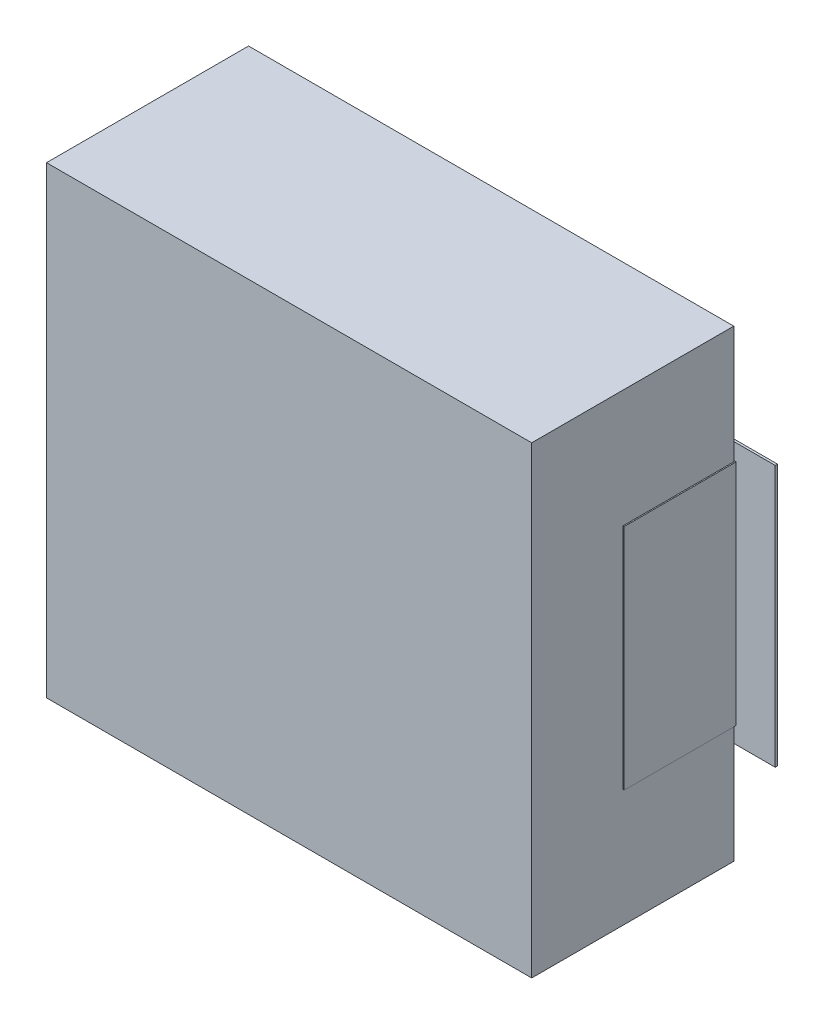
ISO-10303-21;
HEADER;
FILE_DESCRIPTION(('STEP AP214'),'2;1');
FILE_NAME('part.step','',(''),(''),'','','');
FILE_SCHEMA(('AUTOMOTIVE_DESIGN { 1 0 10303 214 1 1 1 1 }'));
ENDSEC;
DATA;
#1=APPLICATION_CONTEXT('core data for automotive mechanical design processes');
#2=APPLICATION_PROTOCOL_DEFINITION('international standard','automotive_design',2000,#1);
#3=PRODUCT_CONTEXT('',#1,'mechanical');
#4=PRODUCT('Part','Part','',(#3));
#5=PRODUCT_RELATED_PRODUCT_CATEGORY('part','',(#4));
#6=PRODUCT_DEFINITION_FORMATION('','',#4);
#7=PRODUCT_DEFINITION_CONTEXT('part definition',#1,'design');
#8=PRODUCT_DEFINITION('design','',#6,#7);
#9=PRODUCT_DEFINITION_SHAPE('','',#8);
#10=(LENGTH_UNIT() NAMED_UNIT(*) SI_UNIT(.MILLI.,.METRE.));
#11=(NAMED_UNIT(*) PLANE_ANGLE_UNIT() SI_UNIT($,.RADIAN.));
#12=(NAMED_UNIT(*) SI_UNIT($,.STERADIAN.) SOLID_ANGLE_UNIT());
#13=UNCERTAINTY_MEASURE_WITH_UNIT(LENGTH_MEASURE(1.E-05),#10,'distance_accuracy_value','');
#14=(GEOMETRIC_REPRESENTATION_CONTEXT(3) GLOBAL_UNCERTAINTY_ASSIGNED_CONTEXT((#13)) GLOBAL_UNIT_ASSIGNED_CONTEXT((#10,
#11,#12)) REPRESENTATION_CONTEXT('',''));
#15=CARTESIAN_POINT('',(0.,0.,0.));
#16=DIRECTION('',(0.,0.,1.));
#17=DIRECTION('',(1.,0.,0.));
#18=AXIS2_PLACEMENT_3D('',#15,#16,#17);
#19=CARTESIAN_POINT('',(0.,0.,0.0762));
#20=DIRECTION('',(0.,0.,1.));
#21=DIRECTION('',(1.,0.,0.));
#22=AXIS2_PLACEMENT_3D('',#19,#20,#21);
#23=PLANE('',#22);
#24=DIRECTION('',(1.,0.,0.));
#25=VECTOR('',#24,1.);
#26=CARTESIAN_POINT('',(-2.478,-1.145,0.0762));
#27=LINE('',#26,#25);
#28=CARTESIAN_POINT('',(-2.478,-1.145,0.0762));
#29=VERTEX_POINT('',#28);
#30=CARTESIAN_POINT('',(-1.078,-1.145,0.0762));
#31=VERTEX_POINT('',#30);
#32=EDGE_CURVE('E176',#29,#31,#27,.T.);
#33=ORIENTED_EDGE('',*,*,#32,.F.);
#34=DIRECTION('',(0.,1.,0.));
#35=VECTOR('',#34,1.);
#36=CARTESIAN_POINT('',(-2.478,1.145,0.0762));
#37=LINE('',#36,#35);
#38=CARTESIAN_POINT('',(-2.478,1.145,0.0762));
#39=VERTEX_POINT('',#38);
#40=EDGE_CURVE('E182',#39,#29,#37,.F.);
#41=ORIENTED_EDGE('',*,*,#40,.F.);
#42=DIRECTION('',(1.,0.,0.));
#43=VECTOR('',#42,1.);
#44=CARTESIAN_POINT('',(0.,1.145,0.0762));
#45=LINE('',#44,#43);
#46=CARTESIAN_POINT('',(-1.078,1.145,0.0762));
#47=VERTEX_POINT('',#46);
#48=EDGE_CURVE('E20',#47,#39,#45,.F.);
#49=ORIENTED_EDGE('',*,*,#48,.F.);
#50=DIRECTION('',(0.,1.,0.));
#51=VECTOR('',#50,1.);
#52=CARTESIAN_POINT('',(-1.078,-1.145,0.0762));
#53=LINE('',#52,#51);
#54=EDGE_CURVE('E192',#31,#47,#53,.T.);
#55=ORIENTED_EDGE('',*,*,#54,.F.);
#56=EDGE_LOOP('',(#33,#41,#49,#55));
#57=FACE_BOUND('',#56,.T.);
#58=ADVANCED_FACE('F17',(#57),#23,.F.);
#59=CARTESIAN_POINT('',(0.,0.,0.0762));
#60=DIRECTION('',(0.,0.,1.));
#61=DIRECTION('',(1.,0.,0.));
#62=AXIS2_PLACEMENT_3D('',#59,#60,#61);
#63=PLANE('',#62);
#64=DIRECTION('',(1.,0.,0.));
#65=VECTOR('',#64,1.);
#66=CARTESIAN_POINT('',(1.078,-1.145,0.0762));
#67=LINE('',#66,#65);
#68=CARTESIAN_POINT('',(1.078,-1.145,0.0762));
#69=VERTEX_POINT('',#68);
#70=CARTESIAN_POINT('',(2.478,-1.145,0.0762));
#71=VERTEX_POINT('',#70);
#72=EDGE_CURVE('E224',#69,#71,#67,.T.);
#73=ORIENTED_EDGE('',*,*,#72,.F.);
#74=DIRECTION('',(0.,1.,0.));
#75=VECTOR('',#74,1.);
#76=CARTESIAN_POINT('',(1.078,1.145,0.0762));
#77=LINE('',#76,#75);
#78=CARTESIAN_POINT('',(1.078,1.145,0.0762));
#79=VERTEX_POINT('',#78);
#80=EDGE_CURVE('E219',#79,#69,#77,.F.);
#81=ORIENTED_EDGE('',*,*,#80,.F.);
#82=DIRECTION('',(1.,0.,0.));
#83=VECTOR('',#82,1.);
#84=CARTESIAN_POINT('',(0.,1.145,0.0762));
#85=LINE('',#84,#83);
#86=CARTESIAN_POINT('',(2.478,1.145,0.0762));
#87=VERTEX_POINT('',#86);
#88=EDGE_CURVE('E189',#87,#79,#85,.F.);
#89=ORIENTED_EDGE('',*,*,#88,.F.);
#90=DIRECTION('',(0.,1.,0.));
#91=VECTOR('',#90,1.);
#92=CARTESIAN_POINT('',(2.478,-1.145,0.0762));
#93=LINE('',#92,#91);
#94=EDGE_CURVE('E229',#71,#87,#93,.T.);
#95=ORIENTED_EDGE('',*,*,#94,.F.);
#96=EDGE_LOOP('',(#73,#81,#89,#95));
#97=FACE_BOUND('',#96,.T.);
#98=ADVANCED_FACE('F647',(#97),#63,.F.);
#99=CARTESIAN_POINT('',(-2.478,1.145,0.0762));
#100=DIRECTION('',(-1.,0.,0.));
#101=DIRECTION('',(0.,0.,1.));
#102=AXIS2_PLACEMENT_3D('',#99,#100,#101);
#103=PLANE('',#102);
#104=DIRECTION('',(0.,0.,1.));
#105=VECTOR('',#104,1.);
#106=CARTESIAN_POINT('',(-2.478,1.145,0.0762));
#107=LINE('',#106,#105);
#108=CARTESIAN_POINT('',(-2.478,1.145,0.0962));
#109=VERTEX_POINT('',#108);
#110=EDGE_CURVE('E187',#39,#109,#107,.T.);
#111=ORIENTED_EDGE('',*,*,#110,.F.);
#112=ORIENTED_EDGE('',*,*,#40,.T.);
#113=DIRECTION('',(0.,0.,-1.));
#114=VECTOR('',#113,1.);
#115=CARTESIAN_POINT('',(-2.478,-1.145,0.0762));
#116=LINE('',#115,#114);
#117=CARTESIAN_POINT('',(-2.478,-1.145,0.0962));
#118=VERTEX_POINT('',#117);
#119=EDGE_CURVE('E184',#118,#29,#116,.T.);
#120=ORIENTED_EDGE('',*,*,#119,.F.);
#121=DIRECTION('',(0.,1.,0.));
#122=VECTOR('',#121,1.);
#123=CARTESIAN_POINT('',(-2.478,0.,0.0962));
#124=LINE('',#123,#122);
#125=EDGE_CURVE('E236',#109,#118,#124,.F.);
#126=ORIENTED_EDGE('',*,*,#125,.F.);
#127=EDGE_LOOP('',(#111,#112,#120,#126));
#128=FACE_BOUND('',#127,.T.);
#129=ADVANCED_FACE('F183',(#128),#103,.T.);
#130=CARTESIAN_POINT('',(-2.478,-1.145,0.0762));
#131=DIRECTION('',(0.,-1.,0.));
#132=DIRECTION('',(0.,0.,-1.));
#133=AXIS2_PLACEMENT_3D('',#130,#131,#132);
#134=PLANE('',#133);
#135=ORIENTED_EDGE('',*,*,#119,.T.);
#136=ORIENTED_EDGE('',*,*,#32,.T.);
#137=DIRECTION('',(0.,0.,-1.));
#138=VECTOR('',#137,1.);
#139=CARTESIAN_POINT('',(-1.078,-1.145,0.0762));
#140=LINE('',#139,#138);
#141=CARTESIAN_POINT('',(-1.078,-1.145,0.0962));
#142=VERTEX_POINT('',#141);
#143=EDGE_CURVE('E194',#142,#31,#140,.T.);
#144=ORIENTED_EDGE('',*,*,#143,.F.);
#145=DIRECTION('',(1.,0.,0.));
#146=VECTOR('',#145,1.);
#147=CARTESIAN_POINT('',(0.,-1.145,0.0962));
#148=LINE('',#147,#146);
#149=EDGE_CURVE('E198',#118,#142,#148,.T.);
#150=ORIENTED_EDGE('',*,*,#149,.F.);
#151=EDGE_LOOP('',(#135,#136,#144,#150));
#152=FACE_BOUND('',#151,.T.);
#153=ADVANCED_FACE('F196',(#152),#134,.T.);
#154=CARTESIAN_POINT('',(-1.078,-1.145,0.0762));
#155=DIRECTION('',(1.,0.,0.));
#156=DIRECTION('',(0.,0.,-1.));
#157=AXIS2_PLACEMENT_3D('',#154,#155,#156);
#158=PLANE('',#157);
#159=ORIENTED_EDGE('',*,*,#143,.T.);
#160=ORIENTED_EDGE('',*,*,#54,.T.);
#161=DIRECTION('',(0.,0.,1.));
#162=VECTOR('',#161,1.);
#163=CARTESIAN_POINT('',(-1.078,1.145,0.0762));
#164=LINE('',#163,#162);
#165=CARTESIAN_POINT('',(-1.078,1.145,0.0962));
#166=VERTEX_POINT('',#165);
#167=EDGE_CURVE('E211',#166,#47,#164,.F.);
#168=ORIENTED_EDGE('',*,*,#167,.F.);
#169=DIRECTION('',(0.,1.,0.));
#170=VECTOR('',#169,1.);
#171=CARTESIAN_POINT('',(-1.078,0.,0.0962));
#172=LINE('',#171,#170);
#173=EDGE_CURVE('E239',#142,#166,#172,.T.);
#174=ORIENTED_EDGE('',*,*,#173,.F.);
#175=EDGE_LOOP('',(#159,#160,#168,#174));
#176=FACE_BOUND('',#175,.T.);
#177=ADVANCED_FACE('F213',(#176),#158,.T.);
#178=CARTESIAN_POINT('',(-1.078,1.145,0.0762));
#179=DIRECTION('',(0.,1.,0.));
#180=DIRECTION('',(0.,0.,1.));
#181=AXIS2_PLACEMENT_3D('',#178,#179,#180);
#182=PLANE('',#181);
#183=ORIENTED_EDGE('',*,*,#167,.T.);
#184=ORIENTED_EDGE('',*,*,#48,.T.);
#185=ORIENTED_EDGE('',*,*,#110,.T.);
#186=DIRECTION('',(1.,0.,0.));
#187=VECTOR('',#186,1.);
#188=CARTESIAN_POINT('',(0.,1.145,0.0962));
#189=LINE('',#188,#187);
#190=EDGE_CURVE('E242',#166,#109,#189,.F.);
#191=ORIENTED_EDGE('',*,*,#190,.F.);
#192=EDGE_LOOP('',(#183,#184,#185,#191));
#193=FACE_BOUND('',#192,.T.);
#194=ADVANCED_FACE('F208',(#193),#182,.T.);
#195=CARTESIAN_POINT('',(1.078,1.145,0.0762));
#196=DIRECTION('',(-1.,0.,0.));
#197=DIRECTION('',(0.,0.,1.));
#198=AXIS2_PLACEMENT_3D('',#195,#196,#197);
#199=PLANE('',#198);
#200=DIRECTION('',(0.,0.,1.));
#201=VECTOR('',#200,1.);
#202=CARTESIAN_POINT('',(1.078,1.145,0.0762));
#203=LINE('',#202,#201);
#204=CARTESIAN_POINT('',(1.078,1.145,0.0962));
#205=VERTEX_POINT('',#204);
#206=EDGE_CURVE('E232',#79,#205,#203,.T.);
#207=ORIENTED_EDGE('',*,*,#206,.F.);
#208=ORIENTED_EDGE('',*,*,#80,.T.);
#209=DIRECTION('',(0.,0.,-1.));
#210=VECTOR('',#209,1.);
#211=CARTESIAN_POINT('',(1.078,-1.145,0.0762));
#212=LINE('',#211,#210);
#213=CARTESIAN_POINT('',(1.078,-1.145,0.0962));
#214=VERTEX_POINT('',#213);
#215=EDGE_CURVE('E221',#214,#69,#212,.T.);
#216=ORIENTED_EDGE('',*,*,#215,.F.);
#217=DIRECTION('',(0.,1.,0.));
#218=VECTOR('',#217,1.);
#219=CARTESIAN_POINT('',(1.078,0.,0.0962));
#220=LINE('',#219,#218);
#221=EDGE_CURVE('E248',#205,#214,#220,.F.);
#222=ORIENTED_EDGE('',*,*,#221,.F.);
#223=EDGE_LOOP('',(#207,#208,#216,#222));
#224=FACE_BOUND('',#223,.T.);
#225=ADVANCED_FACE('F609',(#224),#199,.T.);
#226=CARTESIAN_POINT('',(1.078,-1.145,0.0762));
#227=DIRECTION('',(0.,-1.,0.));
#228=DIRECTION('',(0.,0.,-1.));
#229=AXIS2_PLACEMENT_3D('',#226,#227,#228);
#230=PLANE('',#229);
#231=ORIENTED_EDGE('',*,*,#215,.T.);
#232=ORIENTED_EDGE('',*,*,#72,.T.);
#233=DIRECTION('',(0.,0.,-1.));
#234=VECTOR('',#233,1.);
#235=CARTESIAN_POINT('',(2.478,-1.145,0.0762));
#236=LINE('',#235,#234);
#237=CARTESIAN_POINT('',(2.478,-1.145,0.0962));
#238=VERTEX_POINT('',#237);
#239=EDGE_CURVE('E226',#238,#71,#236,.T.);
#240=ORIENTED_EDGE('',*,*,#239,.F.);
#241=DIRECTION('',(1.,0.,0.));
#242=VECTOR('',#241,1.);
#243=CARTESIAN_POINT('',(0.,-1.145,0.0962));
#244=LINE('',#243,#242);
#245=EDGE_CURVE('E251',#214,#238,#244,.T.);
#246=ORIENTED_EDGE('',*,*,#245,.F.);
#247=EDGE_LOOP('',(#231,#232,#240,#246));
#248=FACE_BOUND('',#247,.T.);
#249=ADVANCED_FACE('F600',(#248),#230,.T.);
#250=CARTESIAN_POINT('',(2.478,-1.145,0.0762));
#251=DIRECTION('',(1.,0.,0.));
#252=DIRECTION('',(0.,0.,-1.));
#253=AXIS2_PLACEMENT_3D('',#250,#251,#252);
#254=PLANE('',#253);
#255=ORIENTED_EDGE('',*,*,#239,.T.);
#256=ORIENTED_EDGE('',*,*,#94,.T.);
#257=DIRECTION('',(0.,0.,1.));
#258=VECTOR('',#257,1.);
#259=CARTESIAN_POINT('',(2.478,1.145,0.0762));
#260=LINE('',#259,#258);
#261=CARTESIAN_POINT('',(2.478,1.145,0.0962));
#262=VERTEX_POINT('',#261);
#263=EDGE_CURVE('E234',#262,#87,#260,.F.);
#264=ORIENTED_EDGE('',*,*,#263,.F.);
#265=DIRECTION('',(0.,1.,0.));
#266=VECTOR('',#265,1.);
#267=CARTESIAN_POINT('',(2.478,0.,0.0962));
#268=LINE('',#267,#266);
#269=EDGE_CURVE('E254',#238,#262,#268,.T.);
#270=ORIENTED_EDGE('',*,*,#269,.F.);
#271=EDGE_LOOP('',(#255,#256,#264,#270));
#272=FACE_BOUND('',#271,.T.);
#273=ADVANCED_FACE('F592',(#272),#254,.T.);
#274=CARTESIAN_POINT('',(2.478,1.145,0.0762));
#275=DIRECTION('',(0.,1.,0.));
#276=DIRECTION('',(0.,0.,1.));
#277=AXIS2_PLACEMENT_3D('',#274,#275,#276);
#278=PLANE('',#277);
#279=ORIENTED_EDGE('',*,*,#263,.T.);
#280=ORIENTED_EDGE('',*,*,#88,.T.);
#281=ORIENTED_EDGE('',*,*,#206,.T.);
#282=DIRECTION('',(1.,0.,0.));
#283=VECTOR('',#282,1.);
#284=CARTESIAN_POINT('',(0.,1.145,0.0962));
#285=LINE('',#284,#283);
#286=EDGE_CURVE('E257',#262,#205,#285,.F.);
#287=ORIENTED_EDGE('',*,*,#286,.F.);
#288=EDGE_LOOP('',(#279,#280,#281,#287));
#289=FACE_BOUND('',#288,.T.);
#290=ADVANCED_FACE('F584',(#289),#278,.T.);
#291=CARTESIAN_POINT('',(0.,0.,0.0962));
#292=DIRECTION('',(0.,0.,1.));
#293=DIRECTION('',(1.,0.,0.));
#294=AXIS2_PLACEMENT_3D('',#291,#292,#293);
#295=PLANE('',#294);
#296=DIRECTION('',(1.,0.,0.));
#297=VECTOR('',#296,1.);
#298=CARTESIAN_POINT('',(0.,-1.,0.0962));
#299=LINE('',#298,#297);
#300=CARTESIAN_POINT('',(-1.375,-1.,0.0962));
#301=VERTEX_POINT('',#300);
#302=CARTESIAN_POINT('',(-2.135,-1.,0.0962));
#303=VERTEX_POINT('',#302);
#304=EDGE_CURVE('E246',#301,#303,#299,.F.);
#305=ORIENTED_EDGE('',*,*,#304,.T.);
#306=DIRECTION('',(0.,1.,0.));
#307=VECTOR('',#306,1.);
#308=CARTESIAN_POINT('',(-2.135,1.,0.0962));
#309=LINE('',#308,#307);
#310=CARTESIAN_POINT('',(-2.135,1.,0.0962));
#311=VERTEX_POINT('',#310);
#312=EDGE_CURVE('E265',#311,#303,#309,.F.);
#313=ORIENTED_EDGE('',*,*,#312,.F.);
#314=DIRECTION('',(1.,0.,0.));
#315=VECTOR('',#314,1.);
#316=CARTESIAN_POINT('',(0.,1.,0.0962));
#317=LINE('',#316,#315);
#318=CARTESIAN_POINT('',(-1.375,1.,0.0962));
#319=VERTEX_POINT('',#318);
#320=EDGE_CURVE('E244',#311,#319,#317,.T.);
#321=ORIENTED_EDGE('',*,*,#320,.T.);
#322=DIRECTION('',(0.,1.,0.));
#323=VECTOR('',#322,1.);
#324=CARTESIAN_POINT('',(-1.375,-1.,0.0962));
#325=LINE('',#324,#323);
#326=EDGE_CURVE('E281',#301,#319,#325,.T.);
#327=ORIENTED_EDGE('',*,*,#326,.F.);
#328=EDGE_LOOP('',(#305,#313,#321,#327));
#329=FACE_BOUND('',#328,.T.);
#330=ORIENTED_EDGE('',*,*,#173,.T.);
#331=ORIENTED_EDGE('',*,*,#190,.T.);
#332=ORIENTED_EDGE('',*,*,#125,.T.);
#333=ORIENTED_EDGE('',*,*,#149,.T.);
#334=EDGE_LOOP('',(#330,#331,#332,#333));
#335=FACE_BOUND('',#334,.T.);
#336=ADVANCED_FACE('F418',(#329,#335),#295,.T.);
#337=CARTESIAN_POINT('',(0.,0.,0.0962));
#338=DIRECTION('',(0.,0.,1.));
#339=DIRECTION('',(1.,0.,0.));
#340=AXIS2_PLACEMENT_3D('',#337,#338,#339);
#341=PLANE('',#340);
#342=DIRECTION('',(0.,1.,0.));
#343=VECTOR('',#342,1.);
#344=CARTESIAN_POINT('',(1.375,1.,0.0962));
#345=LINE('',#344,#343);
#346=CARTESIAN_POINT('',(1.375,1.,0.0962));
#347=VERTEX_POINT('',#346);
#348=CARTESIAN_POINT('',(1.375,-1.,0.0962));
#349=VERTEX_POINT('',#348);
#350=EDGE_CURVE('E278',#347,#349,#345,.F.);
#351=ORIENTED_EDGE('',*,*,#350,.F.);
#352=DIRECTION('',(1.,0.,0.));
#353=VECTOR('',#352,1.);
#354=CARTESIAN_POINT('',(0.,1.,0.0962));
#355=LINE('',#354,#353);
#356=CARTESIAN_POINT('',(2.135,1.,0.0962));
#357=VERTEX_POINT('',#356);
#358=EDGE_CURVE('E263',#347,#357,#355,.T.);
#359=ORIENTED_EDGE('',*,*,#358,.T.);
#360=DIRECTION('',(0.,1.,0.));
#361=VECTOR('',#360,1.);
#362=CARTESIAN_POINT('',(2.135,-1.,0.0962));
#363=LINE('',#362,#361);
#364=CARTESIAN_POINT('',(2.135,-1.,0.0962));
#365=VERTEX_POINT('',#364);
#366=EDGE_CURVE('E287',#365,#357,#363,.T.);
#367=ORIENTED_EDGE('',*,*,#366,.F.);
#368=DIRECTION('',(1.,0.,0.));
#369=VECTOR('',#368,1.);
#370=CARTESIAN_POINT('',(0.,-1.,0.0962));
#371=LINE('',#370,#369);
#372=EDGE_CURVE('E260',#365,#349,#371,.F.);
#373=ORIENTED_EDGE('',*,*,#372,.T.);
#374=EDGE_LOOP('',(#351,#359,#367,#373));
#375=FACE_BOUND('',#374,.T.);
#376=ORIENTED_EDGE('',*,*,#269,.T.);
#377=ORIENTED_EDGE('',*,*,#286,.T.);
#378=ORIENTED_EDGE('',*,*,#221,.T.);
#379=ORIENTED_EDGE('',*,*,#245,.T.);
#380=EDGE_LOOP('',(#376,#377,#378,#379));
#381=FACE_BOUND('',#380,.T.);
#382=ADVANCED_FACE('F425',(#375,#381),#341,.T.);
#383=CARTESIAN_POINT('',(-2.135,1.,0.0762));
#384=DIRECTION('',(-1.,0.,0.));
#385=DIRECTION('',(0.,0.,1.));
#386=AXIS2_PLACEMENT_3D('',#383,#384,#385);
#387=PLANE('',#386);
#388=DIRECTION('',(0.,1.,0.));
#389=VECTOR('',#388,1.);
#390=CARTESIAN_POINT('',(-2.135,0.,1.0762));
#391=LINE('',#390,#389);
#392=CARTESIAN_POINT('',(-2.135,1.,1.0762));
#393=VERTEX_POINT('',#392);
#394=CARTESIAN_POINT('',(-2.135,-1.,1.0762));
#395=VERTEX_POINT('',#394);
#396=EDGE_CURVE('E292',#393,#395,#391,.F.);
#397=ORIENTED_EDGE('',*,*,#396,.F.);
#398=DIRECTION('',(0.,0.,1.));
#399=VECTOR('',#398,1.);
#400=CARTESIAN_POINT('',(-2.135,1.,0.0762));
#401=LINE('',#400,#399);
#402=EDGE_CURVE('E270',#393,#311,#401,.F.);
#403=ORIENTED_EDGE('',*,*,#402,.T.);
#404=ORIENTED_EDGE('',*,*,#312,.T.);
#405=DIRECTION('',(0.,0.,1.));
#406=VECTOR('',#405,1.);
#407=CARTESIAN_POINT('',(-2.135,-1.,0.0762));
#408=LINE('',#407,#406);
#409=EDGE_CURVE('E268',#303,#395,#408,.T.);
#410=ORIENTED_EDGE('',*,*,#409,.T.);
#411=EDGE_LOOP('',(#397,#403,#404,#410));
#412=FACE_BOUND('',#411,.T.);
#413=ADVANCED_FACE('F422',(#412),#387,.T.);
#414=CARTESIAN_POINT('',(1.375,1.,0.0762));
#415=DIRECTION('',(-1.,0.,0.));
#416=DIRECTION('',(0.,0.,1.));
#417=AXIS2_PLACEMENT_3D('',#414,#415,#416);
#418=PLANE('',#417);
#419=DIRECTION('',(0.,0.,1.));
#420=VECTOR('',#419,1.);
#421=CARTESIAN_POINT('',(1.375,1.,0.0762));
#422=LINE('',#421,#420);
#423=CARTESIAN_POINT('',(1.375,1.,0.1062));
#424=VERTEX_POINT('',#423);
#425=EDGE_CURVE('E275',#424,#347,#422,.F.);
#426=ORIENTED_EDGE('',*,*,#425,.T.);
#427=ORIENTED_EDGE('',*,*,#350,.T.);
#428=DIRECTION('',(0.,0.,1.));
#429=VECTOR('',#428,1.);
#430=CARTESIAN_POINT('',(1.375,-1.,0.0762));
#431=LINE('',#430,#429);
#432=CARTESIAN_POINT('',(1.375,-1.,0.1062));
#433=VERTEX_POINT('',#432);
#434=EDGE_CURVE('E273',#349,#433,#431,.T.);
#435=ORIENTED_EDGE('',*,*,#434,.T.);
#436=DIRECTION('',(0.,1.,0.));
#437=VECTOR('',#436,1.);
#438=CARTESIAN_POINT('',(1.375,0.,0.1062));
#439=LINE('',#438,#437);
#440=EDGE_CURVE('E306',#424,#433,#439,.F.);
#441=ORIENTED_EDGE('',*,*,#440,.F.);
#442=EDGE_LOOP('',(#426,#427,#435,#441));
#443=FACE_BOUND('',#442,.T.);
#444=ADVANCED_FACE('F424',(#443),#418,.T.);
#445=CARTESIAN_POINT('',(-1.375,-1.,0.0762));
#446=DIRECTION('',(1.,0.,0.));
#447=DIRECTION('',(0.,0.,-1.));
#448=AXIS2_PLACEMENT_3D('',#445,#446,#447);
#449=PLANE('',#448);
#450=DIRECTION('',(0.,0.,-1.));
#451=VECTOR('',#450,1.);
#452=CARTESIAN_POINT('',(-1.375,-1.,0.0762));
#453=LINE('',#452,#451);
#454=CARTESIAN_POINT('',(-1.375,-1.,0.1062));
#455=VERTEX_POINT('',#454);
#456=EDGE_CURVE('E301',#301,#455,#453,.F.);
#457=ORIENTED_EDGE('',*,*,#456,.F.);
#458=ORIENTED_EDGE('',*,*,#326,.T.);
#459=DIRECTION('',(0.,0.,1.));
#460=VECTOR('',#459,1.);
#461=CARTESIAN_POINT('',(-1.375,1.,0.0762));
#462=LINE('',#461,#460);
#463=CARTESIAN_POINT('',(-1.375,1.,0.1062));
#464=VERTEX_POINT('',#463);
#465=EDGE_CURVE('E298',#464,#319,#462,.F.);
#466=ORIENTED_EDGE('',*,*,#465,.F.);
#467=DIRECTION('',(0.,1.,0.));
#468=VECTOR('',#467,1.);
#469=CARTESIAN_POINT('',(-1.375,0.,0.1062));
#470=LINE('',#469,#468);
#471=EDGE_CURVE('E314',#455,#464,#470,.T.);
#472=ORIENTED_EDGE('',*,*,#471,.F.);
#473=EDGE_LOOP('',(#457,#458,#466,#472));
#474=FACE_BOUND('',#473,.T.);
#475=ADVANCED_FACE('F416',(#474),#449,.T.);
#476=CARTESIAN_POINT('',(2.135,-1.,0.0762));
#477=DIRECTION('',(1.,0.,0.));
#478=DIRECTION('',(0.,0.,-1.));
#479=AXIS2_PLACEMENT_3D('',#476,#477,#478);
#480=PLANE('',#479);
#481=ORIENTED_EDGE('',*,*,#366,.T.);
#482=DIRECTION('',(0.,0.,-1.));
#483=VECTOR('',#482,1.);
#484=CARTESIAN_POINT('',(2.135,1.,0.0762));
#485=LINE('',#484,#483);
#486=CARTESIAN_POINT('',(2.135,1.,1.0762));
#487=VERTEX_POINT('',#486);
#488=EDGE_CURVE('E290',#357,#487,#485,.F.);
#489=ORIENTED_EDGE('',*,*,#488,.T.);
#490=DIRECTION('',(0.,1.,0.));
#491=VECTOR('',#490,1.);
#492=CARTESIAN_POINT('',(2.135,0.,1.0762));
#493=LINE('',#492,#491);
#494=CARTESIAN_POINT('',(2.135,-1.,1.0762));
#495=VERTEX_POINT('',#494);
#496=EDGE_CURVE('E322',#495,#487,#493,.T.);
#497=ORIENTED_EDGE('',*,*,#496,.F.);
#498=DIRECTION('',(0.,0.,-1.));
#499=VECTOR('',#498,1.);
#500=CARTESIAN_POINT('',(2.135,-1.,0.0762));
#501=LINE('',#500,#499);
#502=EDGE_CURVE('E284',#495,#365,#501,.T.);
#503=ORIENTED_EDGE('',*,*,#502,.T.);
#504=EDGE_LOOP('',(#481,#489,#497,#503));
#505=FACE_BOUND('',#504,.T.);
#506=ADVANCED_FACE('F469',(#505),#480,.T.);
#507=CARTESIAN_POINT('',(0.,0.,1.0762));
#508=DIRECTION('',(0.,0.,1.));
#509=DIRECTION('',(1.,0.,0.));
#510=AXIS2_PLACEMENT_3D('',#507,#508,#509);
#511=PLANE('',#510);
#512=DIRECTION('',(1.,0.,0.));
#513=VECTOR('',#512,1.);
#514=CARTESIAN_POINT('',(-2.135,-1.,1.0762));
#515=LINE('',#514,#513);
#516=CARTESIAN_POINT('',(-2.125,-1.,1.0762));
#517=VERTEX_POINT('',#516);
#518=EDGE_CURVE('E303',#517,#395,#515,.F.);
#519=ORIENTED_EDGE('',*,*,#518,.F.);
#520=DIRECTION('',(0.,1.,0.));
#521=VECTOR('',#520,1.);
#522=CARTESIAN_POINT('',(-2.125,-2.03,1.0762));
#523=LINE('',#522,#521);
#524=CARTESIAN_POINT('',(-2.125,1.,1.0762));
#525=VERTEX_POINT('',#524);
#526=EDGE_CURVE('E340',#517,#525,#523,.T.);
#527=ORIENTED_EDGE('',*,*,#526,.T.);
#528=DIRECTION('',(1.,0.,0.));
#529=VECTOR('',#528,1.);
#530=CARTESIAN_POINT('',(-1.375,1.,1.0762));
#531=LINE('',#530,#529);
#532=EDGE_CURVE('E295',#393,#525,#531,.T.);
#533=ORIENTED_EDGE('',*,*,#532,.F.);
#534=ORIENTED_EDGE('',*,*,#396,.T.);
#535=EDGE_LOOP('',(#519,#527,#533,#534));
#536=FACE_BOUND('',#535,.T.);
#537=ADVANCED_FACE('F409',(#536),#511,.T.);
#538=CARTESIAN_POINT('',(-1.375,1.,0.0762));
#539=DIRECTION('',(0.,1.,0.));
#540=DIRECTION('',(0.,0.,1.));
#541=AXIS2_PLACEMENT_3D('',#538,#539,#540);
#542=PLANE('',#541);
#543=ORIENTED_EDGE('',*,*,#320,.F.);
#544=ORIENTED_EDGE('',*,*,#402,.F.);
#545=ORIENTED_EDGE('',*,*,#532,.T.);
#546=DIRECTION('',(0.,0.,-1.));
#547=VECTOR('',#546,1.);
#548=CARTESIAN_POINT('',(-2.125,1.,1.8762));
#549=LINE('',#548,#547);
#550=CARTESIAN_POINT('',(-2.125,1.,0.1062));
#551=VERTEX_POINT('',#550);
#552=EDGE_CURVE('E342',#525,#551,#549,.T.);
#553=ORIENTED_EDGE('',*,*,#552,.T.);
#554=DIRECTION('',(-1.,0.,0.));
#555=VECTOR('',#554,1.);
#556=CARTESIAN_POINT('',(0.,1.,0.1062));
#557=LINE('',#556,#555);
#558=EDGE_CURVE('E317',#464,#551,#557,.T.);
#559=ORIENTED_EDGE('',*,*,#558,.F.);
#560=ORIENTED_EDGE('',*,*,#465,.T.);
#561=EDGE_LOOP('',(#543,#544,#545,#553,#559,#560));
#562=FACE_BOUND('',#561,.T.);
#563=ADVANCED_FACE('F405',(#562),#542,.T.);
#564=CARTESIAN_POINT('',(-2.135,-1.,0.0762));
#565=DIRECTION('',(0.,-1.,0.));
#566=DIRECTION('',(0.,0.,-1.));
#567=AXIS2_PLACEMENT_3D('',#564,#565,#566);
#568=PLANE('',#567);
#569=ORIENTED_EDGE('',*,*,#518,.T.);
#570=ORIENTED_EDGE('',*,*,#409,.F.);
#571=ORIENTED_EDGE('',*,*,#304,.F.);
#572=ORIENTED_EDGE('',*,*,#456,.T.);
#573=DIRECTION('',(-1.,0.,0.));
#574=VECTOR('',#573,1.);
#575=CARTESIAN_POINT('',(0.,-1.,0.1062));
#576=LINE('',#575,#574);
#577=CARTESIAN_POINT('',(-2.125,-1.,0.1062));
#578=VERTEX_POINT('',#577);
#579=EDGE_CURVE('E311',#578,#455,#576,.F.);
#580=ORIENTED_EDGE('',*,*,#579,.F.);
#581=DIRECTION('',(0.,0.,-1.));
#582=VECTOR('',#581,1.);
#583=CARTESIAN_POINT('',(-2.125,-1.,1.8762));
#584=LINE('',#583,#582);
#585=EDGE_CURVE('E351',#578,#517,#584,.F.);
#586=ORIENTED_EDGE('',*,*,#585,.T.);
#587=EDGE_LOOP('',(#569,#570,#571,#572,#580,#586));
#588=FACE_BOUND('',#587,.T.);
#589=ADVANCED_FACE('F412',(#588),#568,.T.);
#590=CARTESIAN_POINT('',(0.,0.,0.1062));
#591=DIRECTION('',(0.,0.,-1.));
#592=DIRECTION('',(-1.,0.,0.));
#593=AXIS2_PLACEMENT_3D('',#590,#591,#592);
#594=PLANE('',#593);
#595=DIRECTION('',(1.,0.,0.));
#596=VECTOR('',#595,1.);
#597=CARTESIAN_POINT('',(2.225,2.03,0.1062));
#598=LINE('',#597,#596);
#599=CARTESIAN_POINT('',(2.125,2.03,0.1062));
#600=VERTEX_POINT('',#599);
#601=CARTESIAN_POINT('',(-2.125,2.03,0.1062));
#602=VERTEX_POINT('',#601);
#603=EDGE_CURVE('E337',#600,#602,#598,.F.);
#604=ORIENTED_EDGE('',*,*,#603,.F.);
#605=DIRECTION('',(0.,1.,0.));
#606=VECTOR('',#605,1.);
#607=CARTESIAN_POINT('',(2.125,0.,0.1062));
#608=LINE('',#607,#606);
#609=CARTESIAN_POINT('',(2.125,1.,0.1062));
#610=VERTEX_POINT('',#609);
#611=EDGE_CURVE('E320',#600,#610,#608,.F.);
#612=ORIENTED_EDGE('',*,*,#611,.T.);
#613=DIRECTION('',(1.,0.,0.));
#614=VECTOR('',#613,1.);
#615=CARTESIAN_POINT('',(2.135,1.,0.1062));
#616=LINE('',#615,#614);
#617=EDGE_CURVE('E331',#424,#610,#616,.T.);
#618=ORIENTED_EDGE('',*,*,#617,.F.);
#619=ORIENTED_EDGE('',*,*,#440,.T.);
#620=DIRECTION('',(1.,0.,0.));
#621=VECTOR('',#620,1.);
#622=CARTESIAN_POINT('',(1.375,-1.,0.1062));
#623=LINE('',#622,#621);
#624=CARTESIAN_POINT('',(2.125,-1.,0.1062));
#625=VERTEX_POINT('',#624);
#626=EDGE_CURVE('E328',#625,#433,#623,.F.);
#627=ORIENTED_EDGE('',*,*,#626,.F.);
#628=DIRECTION('',(0.,1.,0.));
#629=VECTOR('',#628,1.);
#630=CARTESIAN_POINT('',(2.125,0.,0.1062));
#631=LINE('',#630,#629);
#632=CARTESIAN_POINT('',(2.125,-2.03,0.1062));
#633=VERTEX_POINT('',#632);
#634=EDGE_CURVE('E309',#625,#633,#631,.F.);
#635=ORIENTED_EDGE('',*,*,#634,.T.);
#636=DIRECTION('',(1.,0.,0.));
#637=VECTOR('',#636,1.);
#638=CARTESIAN_POINT('',(-2.225,-2.03,0.1062));
#639=LINE('',#638,#637);
#640=CARTESIAN_POINT('',(-2.125,-2.03,0.1062));
#641=VERTEX_POINT('',#640);
#642=EDGE_CURVE('E357',#641,#633,#639,.T.);
#643=ORIENTED_EDGE('',*,*,#642,.F.);
#644=DIRECTION('',(0.,1.,0.));
#645=VECTOR('',#644,1.);
#646=CARTESIAN_POINT('',(-2.125,-2.03,0.1062));
#647=LINE('',#646,#645);
#648=EDGE_CURVE('E348',#641,#578,#647,.T.);
#649=ORIENTED_EDGE('',*,*,#648,.T.);
#650=ORIENTED_EDGE('',*,*,#579,.T.);
#651=ORIENTED_EDGE('',*,*,#471,.T.);
#652=ORIENTED_EDGE('',*,*,#558,.T.);
#653=DIRECTION('',(0.,1.,0.));
#654=VECTOR('',#653,1.);
#655=CARTESIAN_POINT('',(-2.125,-2.03,0.1062));
#656=LINE('',#655,#654);
#657=EDGE_CURVE('E344',#551,#602,#656,.T.);
#658=ORIENTED_EDGE('',*,*,#657,.T.);
#659=EDGE_LOOP('',(#604,#612,#618,#619,#627,#635,#643,#649,#650,#651,#652,#658));
#660=FACE_BOUND('',#659,.T.);
#661=ADVANCED_FACE('F390',(#660),#594,.T.);
#662=CARTESIAN_POINT('',(0.,0.,1.0762));
#663=DIRECTION('',(0.,0.,1.));
#664=DIRECTION('',(1.,0.,0.));
#665=AXIS2_PLACEMENT_3D('',#662,#663,#664);
#666=PLANE('',#665);
#667=DIRECTION('',(1.,0.,0.));
#668=VECTOR('',#667,1.);
#669=CARTESIAN_POINT('',(2.135,1.,1.0762));
#670=LINE('',#669,#668);
#671=CARTESIAN_POINT('',(2.125,1.,1.0762));
#672=VERTEX_POINT('',#671);
#673=EDGE_CURVE('E334',#672,#487,#670,.T.);
#674=ORIENTED_EDGE('',*,*,#673,.F.);
#675=DIRECTION('',(0.,1.,0.));
#676=VECTOR('',#675,1.);
#677=CARTESIAN_POINT('',(2.125,2.03,1.0762));
#678=LINE('',#677,#676);
#679=CARTESIAN_POINT('',(2.125,-1.,1.0762));
#680=VERTEX_POINT('',#679);
#681=EDGE_CURVE('E359',#672,#680,#678,.F.);
#682=ORIENTED_EDGE('',*,*,#681,.T.);
#683=DIRECTION('',(1.,0.,0.));
#684=VECTOR('',#683,1.);
#685=CARTESIAN_POINT('',(1.375,-1.,1.0762));
#686=LINE('',#685,#684);
#687=EDGE_CURVE('E325',#495,#680,#686,.F.);
#688=ORIENTED_EDGE('',*,*,#687,.F.);
#689=ORIENTED_EDGE('',*,*,#496,.T.);
#690=EDGE_LOOP('',(#674,#682,#688,#689));
#691=FACE_BOUND('',#690,.T.);
#692=ADVANCED_FACE('F456',(#691),#666,.T.);
#693=CARTESIAN_POINT('',(1.375,-1.,0.0762));
#694=DIRECTION('',(0.,-1.,0.));
#695=DIRECTION('',(0.,0.,-1.));
#696=AXIS2_PLACEMENT_3D('',#693,#694,#695);
#697=PLANE('',#696);
#698=ORIENTED_EDGE('',*,*,#372,.F.);
#699=ORIENTED_EDGE('',*,*,#502,.F.);
#700=ORIENTED_EDGE('',*,*,#687,.T.);
#701=DIRECTION('',(0.,0.,1.));
#702=VECTOR('',#701,1.);
#703=CARTESIAN_POINT('',(2.125,-1.,1.8762));
#704=LINE('',#703,#702);
#705=EDGE_CURVE('E361',#680,#625,#704,.F.);
#706=ORIENTED_EDGE('',*,*,#705,.T.);
#707=ORIENTED_EDGE('',*,*,#626,.T.);
#708=ORIENTED_EDGE('',*,*,#434,.F.);
#709=EDGE_LOOP('',(#698,#699,#700,#706,#707,#708));
#710=FACE_BOUND('',#709,.T.);
#711=ADVANCED_FACE('F452',(#710),#697,.T.);
#712=CARTESIAN_POINT('',(2.135,1.,0.0762));
#713=DIRECTION('',(0.,1.,0.));
#714=DIRECTION('',(0.,0.,1.));
#715=AXIS2_PLACEMENT_3D('',#712,#713,#714);
#716=PLANE('',#715);
#717=ORIENTED_EDGE('',*,*,#673,.T.);
#718=ORIENTED_EDGE('',*,*,#488,.F.);
#719=ORIENTED_EDGE('',*,*,#358,.F.);
#720=ORIENTED_EDGE('',*,*,#425,.F.);
#721=ORIENTED_EDGE('',*,*,#617,.T.);
#722=DIRECTION('',(0.,0.,1.));
#723=VECTOR('',#722,1.);
#724=CARTESIAN_POINT('',(2.125,1.,1.8762));
#725=LINE('',#724,#723);
#726=EDGE_CURVE('E368',#610,#672,#725,.T.);
#727=ORIENTED_EDGE('',*,*,#726,.T.);
#728=EDGE_LOOP('',(#717,#718,#719,#720,#721,#727));
#729=FACE_BOUND('',#728,.T.);
#730=ADVANCED_FACE('F449',(#729),#716,.T.);
#731=CARTESIAN_POINT('',(2.225,2.03,0.0762));
#732=DIRECTION('',(0.,1.,0.));
#733=DIRECTION('',(0.,0.,1.));
#734=AXIS2_PLACEMENT_3D('',#731,#732,#733);
#735=PLANE('',#734);
#736=DIRECTION('',(0.,0.,1.));
#737=VECTOR('',#736,1.);
#738=CARTESIAN_POINT('',(2.125,2.03,1.8762));
#739=LINE('',#738,#737);
#740=CARTESIAN_POINT('',(2.125,2.03,1.8762));
#741=VERTEX_POINT('',#740);
#742=EDGE_CURVE('E365',#741,#600,#739,.F.);
#743=ORIENTED_EDGE('',*,*,#742,.T.);
#744=ORIENTED_EDGE('',*,*,#603,.T.);
#745=DIRECTION('',(0.,0.,-1.));
#746=VECTOR('',#745,1.);
#747=CARTESIAN_POINT('',(-2.125,2.03,1.8762));
#748=LINE('',#747,#746);
#749=CARTESIAN_POINT('',(-2.125,2.03,1.8762));
#750=VERTEX_POINT('',#749);
#751=EDGE_CURVE('E346',#602,#750,#748,.F.);
#752=ORIENTED_EDGE('',*,*,#751,.T.);
#753=DIRECTION('',(1.,0.,0.));
#754=VECTOR('',#753,1.);
#755=CARTESIAN_POINT('',(0.,2.03,1.8762));
#756=LINE('',#755,#754);
#757=EDGE_CURVE('E371',#741,#750,#756,.F.);
#758=ORIENTED_EDGE('',*,*,#757,.F.);
#759=EDGE_LOOP('',(#743,#744,#752,#758));
#760=FACE_BOUND('',#759,.T.);
#761=ADVANCED_FACE('F399',(#760),#735,.T.);
#762=CARTESIAN_POINT('',(-2.125,-2.03,1.8762));
#763=DIRECTION('',(1.,0.,0.));
#764=DIRECTION('',(0.,0.,-1.));
#765=AXIS2_PLACEMENT_3D('',#762,#763,#764);
#766=PLANE('',#765);
#767=ORIENTED_EDGE('',*,*,#648,.F.);
#768=DIRECTION('',(0.,0.,-1.));
#769=VECTOR('',#768,1.);
#770=CARTESIAN_POINT('',(-2.125,-2.03,0.0762));
#771=LINE('',#770,#769);
#772=CARTESIAN_POINT('',(-2.125,-2.03,1.8762));
#773=VERTEX_POINT('',#772);
#774=EDGE_CURVE('E354',#773,#641,#771,.T.);
#775=ORIENTED_EDGE('',*,*,#774,.F.);
#776=DIRECTION('',(0.,1.,0.));
#777=VECTOR('',#776,1.);
#778=CARTESIAN_POINT('',(-2.125,0.,1.8762));
#779=LINE('',#778,#777);
#780=EDGE_CURVE('E374',#750,#773,#779,.F.);
#781=ORIENTED_EDGE('',*,*,#780,.F.);
#782=ORIENTED_EDGE('',*,*,#751,.F.);
#783=ORIENTED_EDGE('',*,*,#657,.F.);
#784=ORIENTED_EDGE('',*,*,#552,.F.);
#785=ORIENTED_EDGE('',*,*,#526,.F.);
#786=ORIENTED_EDGE('',*,*,#585,.F.);
#787=EDGE_LOOP('',(#767,#775,#781,#782,#783,#784,#785,#786));
#788=FACE_BOUND('',#787,.T.);
#789=ADVANCED_FACE('F384',(#788),#766,.F.);
#790=CARTESIAN_POINT('',(-2.225,-2.03,0.0762));
#791=DIRECTION('',(0.,-1.,0.));
#792=DIRECTION('',(0.,0.,-1.));
#793=AXIS2_PLACEMENT_3D('',#790,#791,#792);
#794=PLANE('',#793);
#795=ORIENTED_EDGE('',*,*,#774,.T.);
#796=ORIENTED_EDGE('',*,*,#642,.T.);
#797=DIRECTION('',(0.,0.,1.));
#798=VECTOR('',#797,1.);
#799=CARTESIAN_POINT('',(2.125,-2.03,1.8762));
#800=LINE('',#799,#798);
#801=CARTESIAN_POINT('',(2.125,-2.03,1.8762));
#802=VERTEX_POINT('',#801);
#803=EDGE_CURVE('E35',#633,#802,#800,.T.);
#804=ORIENTED_EDGE('',*,*,#803,.T.);
#805=DIRECTION('',(1.,0.,0.));
#806=VECTOR('',#805,1.);
#807=CARTESIAN_POINT('',(0.,-2.03,1.8762));
#808=LINE('',#807,#806);
#809=EDGE_CURVE('E26',#773,#802,#808,.T.);
#810=ORIENTED_EDGE('',*,*,#809,.F.);
#811=EDGE_LOOP('',(#795,#796,#804,#810));
#812=FACE_BOUND('',#811,.T.);
#813=ADVANCED_FACE('F381',(#812),#794,.T.);
#814=CARTESIAN_POINT('',(2.125,2.03,1.8762));
#815=DIRECTION('',(-1.,0.,0.));
#816=DIRECTION('',(0.,0.,1.));
#817=AXIS2_PLACEMENT_3D('',#814,#815,#816);
#818=PLANE('',#817);
#819=ORIENTED_EDGE('',*,*,#611,.F.);
#820=ORIENTED_EDGE('',*,*,#742,.F.);
#821=DIRECTION('',(0.,1.,0.));
#822=VECTOR('',#821,1.);
#823=CARTESIAN_POINT('',(2.125,0.,1.8762));
#824=LINE('',#823,#822);
#825=EDGE_CURVE('E11',#802,#741,#824,.T.);
#826=ORIENTED_EDGE('',*,*,#825,.F.);
#827=ORIENTED_EDGE('',*,*,#803,.F.);
#828=ORIENTED_EDGE('',*,*,#634,.F.);
#829=ORIENTED_EDGE('',*,*,#705,.F.);
#830=ORIENTED_EDGE('',*,*,#681,.F.);
#831=ORIENTED_EDGE('',*,*,#726,.F.);
#832=EDGE_LOOP('',(#819,#820,#826,#827,#828,#829,#830,#831));
#833=FACE_BOUND('',#832,.T.);
#834=ADVANCED_FACE('F394',(#833),#818,.F.);
#835=CARTESIAN_POINT('',(0.,0.,1.8762));
#836=DIRECTION('',(0.,0.,1.));
#837=DIRECTION('',(1.,0.,0.));
#838=AXIS2_PLACEMENT_3D('',#835,#836,#837);
#839=PLANE('',#838);
#840=ORIENTED_EDGE('',*,*,#809,.T.);
#841=ORIENTED_EDGE('',*,*,#825,.T.);
#842=ORIENTED_EDGE('',*,*,#757,.T.);
#843=ORIENTED_EDGE('',*,*,#780,.T.);
#844=EDGE_LOOP('',(#840,#841,#842,#843));
#845=FACE_BOUND('',#844,.T.);
#846=ADVANCED_FACE('F379',(#845),#839,.T.);
#847=CLOSED_SHELL('',(#58,#98,#129,#153,#177,#194,#225,#249,#273,#290,#336,#382,#413,#444,#475,
#506,#537,#563,#589,#661,#692,#711,#730,#761,#789,#813,#834,#846));
#848=MANIFOLD_SOLID_BREP('B1',#847);
#849=ADVANCED_BREP_SHAPE_REPRESENTATION('',(#18,#848),#14);
#850=SHAPE_DEFINITION_REPRESENTATION(#9,#849);
ENDSEC;
END-ISO-10303-21;
